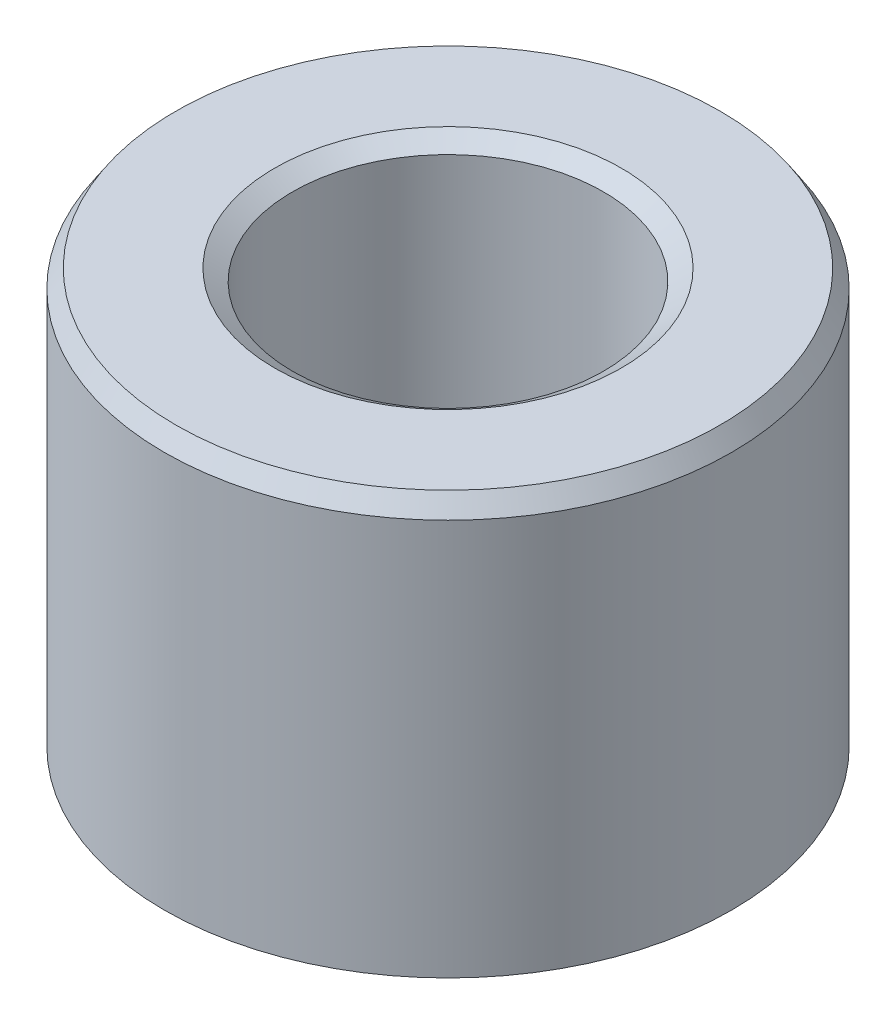
ISO-10303-21;
HEADER;
FILE_DESCRIPTION(('STEP AP214'),'2;1');
FILE_NAME('part.step','',(''),(''),'','','');
FILE_SCHEMA(('AUTOMOTIVE_DESIGN { 1 0 10303 214 1 1 1 1 }'));
ENDSEC;
DATA;
#1=APPLICATION_CONTEXT('core data for automotive mechanical design processes');
#2=APPLICATION_PROTOCOL_DEFINITION('international standard','automotive_design',2000,#1);
#3=PRODUCT_CONTEXT('',#1,'mechanical');
#4=PRODUCT('Part','Part','',(#3));
#5=PRODUCT_RELATED_PRODUCT_CATEGORY('part','',(#4));
#6=PRODUCT_DEFINITION_FORMATION('','',#4);
#7=PRODUCT_DEFINITION_CONTEXT('part definition',#1,'design');
#8=PRODUCT_DEFINITION('design','',#6,#7);
#9=PRODUCT_DEFINITION_SHAPE('','',#8);
#10=(LENGTH_UNIT() NAMED_UNIT(*) SI_UNIT(.MILLI.,.METRE.));
#11=(NAMED_UNIT(*) PLANE_ANGLE_UNIT() SI_UNIT($,.RADIAN.));
#12=(NAMED_UNIT(*) SI_UNIT($,.STERADIAN.) SOLID_ANGLE_UNIT());
#13=UNCERTAINTY_MEASURE_WITH_UNIT(LENGTH_MEASURE(1.E-05),#10,'distance_accuracy_value','');
#14=(GEOMETRIC_REPRESENTATION_CONTEXT(3) GLOBAL_UNCERTAINTY_ASSIGNED_CONTEXT((#13)) GLOBAL_UNIT_ASSIGNED_CONTEXT((#10,
#11,#12)) REPRESENTATION_CONTEXT('',''));
#15=CARTESIAN_POINT('',(0.,0.,0.));
#16=DIRECTION('',(0.,0.,1.));
#17=DIRECTION('',(1.,0.,0.));
#18=AXIS2_PLACEMENT_3D('',#15,#16,#17);
#19=CARTESIAN_POINT('',(0.,63.7994004781286,0.));
#20=DIRECTION('',(0.,-1.,0.));
#21=DIRECTION('',(0.,0.,-1.));
#22=AXIS2_PLACEMENT_3D('',#19,#20,#21);
#23=CYLINDRICAL_SURFACE('',#22,42.5);
#24=CARTESIAN_POINT('',(0.,1.74277333620303,0.));
#25=DIRECTION('',(0.,1.,0.));
#26=DIRECTION('',(0.,0.,1.));
#27=AXIS2_PLACEMENT_3D('',#24,#25,#26);
#28=CIRCLE('',#27,42.5);
#29=CARTESIAN_POINT('',(0.,1.74277333620303,42.5));
#30=VERTEX_POINT('',#29);
#31=EDGE_CURVE('E10',#30,#30,#28,.T.);
#32=ORIENTED_EDGE('',*,*,#31,.T.);
#33=EDGE_LOOP('',(#32));
#34=FACE_BOUND('',#33,.T.);
#35=CARTESIAN_POINT('',(0.,61.1316610368273,0.));
#36=DIRECTION('',(0.,1.,0.));
#37=DIRECTION('',(0.,0.,1.));
#38=AXIS2_PLACEMENT_3D('',#35,#36,#37);
#39=CIRCLE('',#38,42.5);
#40=CARTESIAN_POINT('',(0.,61.1316610368273,42.5));
#41=VERTEX_POINT('',#40);
#42=EDGE_CURVE('E50',#41,#41,#39,.F.);
#43=ORIENTED_EDGE('',*,*,#42,.T.);
#44=EDGE_LOOP('',(#43));
#45=FACE_BOUND('',#44,.T.);
#46=ADVANCED_FACE('F39',(#34,#45),#23,.T.);
#47=CARTESIAN_POINT('',(0.,63.7994004781286,0.));
#48=DIRECTION('',(0.,1.,0.));
#49=DIRECTION('',(0.,0.,1.));
#50=AXIS2_PLACEMENT_3D('',#47,#48,#49);
#51=PLANE('',#50);
#52=CARTESIAN_POINT('',(0.,63.7994004781286,0.));
#53=DIRECTION('',(0.,1.,0.));
#54=DIRECTION('',(0.,0.,1.));
#55=AXIS2_PLACEMENT_3D('',#52,#53,#54);
#56=CIRCLE('',#55,25.9638316391746);
#57=CARTESIAN_POINT('',(0.,63.7994004781286,25.9638316391746));
#58=VERTEX_POINT('',#57);
#59=EDGE_CURVE('E58',#58,#58,#56,.F.);
#60=ORIENTED_EDGE('',*,*,#59,.T.);
#61=EDGE_LOOP('',(#60));
#62=FACE_BOUND('',#61,.T.);
#63=CARTESIAN_POINT('',(0.,63.7994004781286,0.));
#64=DIRECTION('',(0.,1.,0.));
#65=DIRECTION('',(0.,0.,1.));
#66=AXIS2_PLACEMENT_3D('',#63,#64,#65);
#67=CIRCLE('',#66,40.757226663797);
#68=CARTESIAN_POINT('',(0.,63.7994004781286,40.757226663797));
#69=VERTEX_POINT('',#68);
#70=EDGE_CURVE('E61',#69,#69,#67,.T.);
#71=ORIENTED_EDGE('',*,*,#70,.T.);
#72=EDGE_LOOP('',(#71));
#73=FACE_BOUND('',#72,.T.);
#74=ADVANCED_FACE('F88',(#62,#73),#51,.T.);
#75=CARTESIAN_POINT('',(0.,0.,0.));
#76=DIRECTION('',(0.,1.,0.));
#77=DIRECTION('',(0.,0.,1.));
#78=AXIS2_PLACEMENT_3D('',#75,#76,#77);
#79=PLANE('',#78);
#80=CARTESIAN_POINT('',(0.,0.,0.));
#81=DIRECTION('',(0.,1.,0.));
#82=DIRECTION('',(0.,0.,1.));
#83=AXIS2_PLACEMENT_3D('',#80,#81,#82);
#84=CIRCLE('',#83,25.0388655340762);
#85=CARTESIAN_POINT('',(0.,0.,25.0388655340762));
#86=VERTEX_POINT('',#85);
#87=EDGE_CURVE('E51',#86,#86,#84,.T.);
#88=ORIENTED_EDGE('',*,*,#87,.T.);
#89=EDGE_LOOP('',(#88));
#90=FACE_BOUND('',#89,.T.);
#91=CARTESIAN_POINT('',(0.,0.,0.));
#92=DIRECTION('',(0.,1.,0.));
#93=DIRECTION('',(0.,0.,1.));
#94=AXIS2_PLACEMENT_3D('',#91,#92,#93);
#95=CIRCLE('',#94,39.8322605586987);
#96=CARTESIAN_POINT('',(0.,0.,39.8322605586987));
#97=VERTEX_POINT('',#96);
#98=EDGE_CURVE('E54',#97,#97,#95,.F.);
#99=ORIENTED_EDGE('',*,*,#98,.T.);
#100=EDGE_LOOP('',(#99));
#101=FACE_BOUND('',#100,.T.);
#102=ADVANCED_FACE('F83',(#90,#101),#79,.F.);
#103=CARTESIAN_POINT('',(0.,63.7994004781286,0.));
#104=DIRECTION('',(0.,-1.,0.));
#105=DIRECTION('',(0.,0.,-1.));
#106=AXIS2_PLACEMENT_3D('',#103,#104,#105);
#107=CYLINDRICAL_SURFACE('',#106,23.2960921978732);
#108=CARTESIAN_POINT('',(0.,62.0566271419256,0.));
#109=DIRECTION('',(0.,1.,0.));
#110=DIRECTION('',(0.,0.,1.));
#111=AXIS2_PLACEMENT_3D('',#108,#109,#110);
#112=CIRCLE('',#111,23.2960921978732);
#113=CARTESIAN_POINT('',(0.,62.0566271419256,23.2960921978732));
#114=VERTEX_POINT('',#113);
#115=EDGE_CURVE('E67',#114,#114,#112,.T.);
#116=ORIENTED_EDGE('',*,*,#115,.T.);
#117=EDGE_LOOP('',(#116));
#118=FACE_BOUND('',#117,.T.);
#119=CARTESIAN_POINT('',(0.,2.66773944130132,0.));
#120=DIRECTION('',(0.,1.,0.));
#121=DIRECTION('',(0.,0.,1.));
#122=AXIS2_PLACEMENT_3D('',#119,#120,#121);
#123=CIRCLE('',#122,23.2960921978732);
#124=CARTESIAN_POINT('',(0.,2.66773944130132,23.2960921978732));
#125=VERTEX_POINT('',#124);
#126=EDGE_CURVE('E69',#125,#125,#123,.F.);
#127=ORIENTED_EDGE('',*,*,#126,.T.);
#128=EDGE_LOOP('',(#127));
#129=FACE_BOUND('',#128,.T.);
#130=ADVANCED_FACE('F71',(#118,#129),#107,.F.);
#131=CARTESIAN_POINT('',(0.,62.0566271419256,0.));
#132=DIRECTION('',(0.,1.,0.));
#133=DIRECTION('',(0.,0.,1.));
#134=AXIS2_PLACEMENT_3D('',#131,#132,#133);
#135=CONICAL_SURFACE('',#134,23.2960921978732,0.992120728077877);
#136=ORIENTED_EDGE('',*,*,#59,.F.);
#137=EDGE_LOOP('',(#136));
#138=FACE_BOUND('',#137,.T.);
#139=ORIENTED_EDGE('',*,*,#115,.F.);
#140=EDGE_LOOP('',(#139));
#141=FACE_BOUND('',#140,.T.);
#142=ADVANCED_FACE('F77',(#138,#141),#135,.F.);
#143=CARTESIAN_POINT('',(0.,0.,0.));
#144=DIRECTION('',(0.,-1.,0.));
#145=DIRECTION('',(0.,0.,-1.));
#146=AXIS2_PLACEMENT_3D('',#143,#144,#145);
#147=CONICAL_SURFACE('',#146,25.0388655340762,0.578675598717023);
#148=ORIENTED_EDGE('',*,*,#126,.F.);
#149=EDGE_LOOP('',(#148));
#150=FACE_BOUND('',#149,.T.);
#151=ORIENTED_EDGE('',*,*,#87,.F.);
#152=EDGE_LOOP('',(#151));
#153=FACE_BOUND('',#152,.T.);
#154=ADVANCED_FACE('F73',(#150,#153),#147,.F.);
#155=CARTESIAN_POINT('',(0.,1.74277333620303,0.));
#156=DIRECTION('',(0.,1.,0.));
#157=DIRECTION('',(0.,0.,1.));
#158=AXIS2_PLACEMENT_3D('',#155,#156,#157);
#159=CONICAL_SURFACE('',#158,42.5,0.992120728077876);
#160=ORIENTED_EDGE('',*,*,#98,.F.);
#161=EDGE_LOOP('',(#160));
#162=FACE_BOUND('',#161,.T.);
#163=ORIENTED_EDGE('',*,*,#31,.F.);
#164=EDGE_LOOP('',(#163));
#165=FACE_BOUND('',#164,.T.);
#166=ADVANCED_FACE('F76',(#162,#165),#159,.T.);
#167=CARTESIAN_POINT('',(0.,63.7994004781286,0.));
#168=DIRECTION('',(0.,-1.,0.));
#169=DIRECTION('',(0.,0.,-1.));
#170=AXIS2_PLACEMENT_3D('',#167,#168,#169);
#171=CONICAL_SURFACE('',#170,40.757226663797,0.578675598717025);
#172=ORIENTED_EDGE('',*,*,#42,.F.);
#173=EDGE_LOOP('',(#172));
#174=FACE_BOUND('',#173,.T.);
#175=ORIENTED_EDGE('',*,*,#70,.F.);
#176=EDGE_LOOP('',(#175));
#177=FACE_BOUND('',#176,.T.);
#178=ADVANCED_FACE('F45',(#174,#177),#171,.T.);
#179=CLOSED_SHELL('',(#46,#74,#102,#130,#142,#154,#166,#178));
#180=MANIFOLD_SOLID_BREP('B2',#179);
#181=ADVANCED_BREP_SHAPE_REPRESENTATION('',(#18,#180),#14);
#182=SHAPE_DEFINITION_REPRESENTATION(#9,#181);
ENDSEC;
END-ISO-10303-21;
